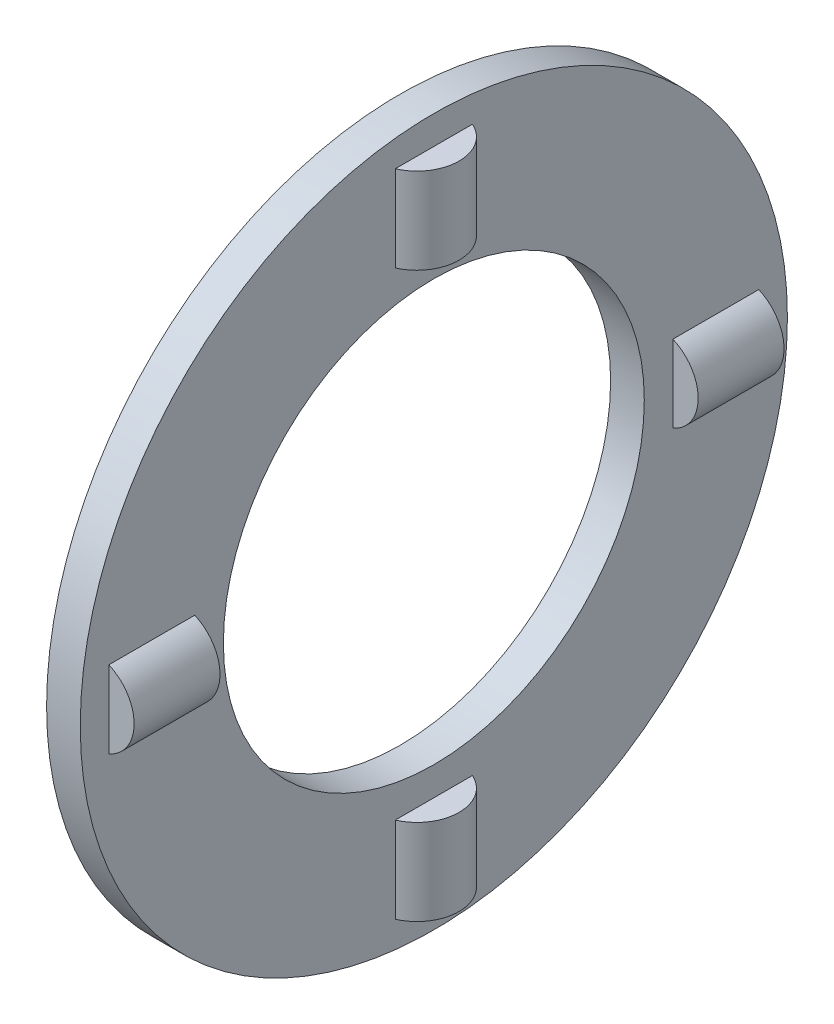
ISO-10303-21;
HEADER;
FILE_DESCRIPTION(('STEP AP214'),'2;1');
FILE_NAME('part.step','',(''),(''),'','','');
FILE_SCHEMA(('AUTOMOTIVE_DESIGN { 1 0 10303 214 1 1 1 1 }'));
ENDSEC;
DATA;
#1=APPLICATION_CONTEXT('core data for automotive mechanical design processes');
#2=APPLICATION_PROTOCOL_DEFINITION('international standard','automotive_design',2000,#1);
#3=PRODUCT_CONTEXT('',#1,'mechanical');
#4=PRODUCT('Part','Part','',(#3));
#5=PRODUCT_RELATED_PRODUCT_CATEGORY('part','',(#4));
#6=PRODUCT_DEFINITION_FORMATION('','',#4);
#7=PRODUCT_DEFINITION_CONTEXT('part definition',#1,'design');
#8=PRODUCT_DEFINITION('design','',#6,#7);
#9=PRODUCT_DEFINITION_SHAPE('','',#8);
#10=(LENGTH_UNIT() NAMED_UNIT(*) SI_UNIT(.MILLI.,.METRE.));
#11=(NAMED_UNIT(*) PLANE_ANGLE_UNIT() SI_UNIT($,.RADIAN.));
#12=(NAMED_UNIT(*) SI_UNIT($,.STERADIAN.) SOLID_ANGLE_UNIT());
#13=UNCERTAINTY_MEASURE_WITH_UNIT(LENGTH_MEASURE(1.E-05),#10,'distance_accuracy_value','');
#14=(GEOMETRIC_REPRESENTATION_CONTEXT(3) GLOBAL_UNCERTAINTY_ASSIGNED_CONTEXT((#13)) GLOBAL_UNIT_ASSIGNED_CONTEXT((#10,
#11,#12)) REPRESENTATION_CONTEXT('',''));
#15=CARTESIAN_POINT('',(0.,0.,0.));
#16=DIRECTION('',(0.,0.,1.));
#17=DIRECTION('',(1.,0.,0.));
#18=AXIS2_PLACEMENT_3D('',#15,#16,#17);
#19=CARTESIAN_POINT('',(4.5,21.,0.));
#20=DIRECTION('',(1.,0.,0.));
#21=DIRECTION('',(0.,0.,-1.));
#22=AXIS2_PLACEMENT_3D('',#19,#20,#21);
#23=PLANE('',#22);
#24=DIRECTION('',(0.,-1.,0.));
#25=VECTOR('',#24,1.);
#26=CARTESIAN_POINT('',(4.5,21.,-14.2));
#27=LINE('',#26,#25);
#28=CARTESIAN_POINT('',(4.5,2.29128784747792,-14.2));
#29=VERTEX_POINT('',#28);
#30=CARTESIAN_POINT('',(4.5,-2.29128784747792,-14.2));
#31=VERTEX_POINT('',#30);
#32=EDGE_CURVE('E297',#29,#31,#27,.T.);
#33=ORIENTED_EDGE('',*,*,#32,.T.);
#34=DIRECTION('',(0.,0.,-1.));
#35=VECTOR('',#34,1.);
#36=CARTESIAN_POINT('',(4.5,-2.29128784747792,-14.2));
#37=LINE('',#36,#35);
#38=CARTESIAN_POINT('',(4.5,-2.29128784747792,-19.3));
#39=VERTEX_POINT('',#38);
#40=EDGE_CURVE('E301',#31,#39,#37,.T.);
#41=ORIENTED_EDGE('',*,*,#40,.T.);
#42=DIRECTION('',(0.,1.,0.));
#43=VECTOR('',#42,1.);
#44=CARTESIAN_POINT('',(4.5,21.,-19.3));
#45=LINE('',#44,#43);
#46=CARTESIAN_POINT('',(4.5,2.29128784747792,-19.3));
#47=VERTEX_POINT('',#46);
#48=EDGE_CURVE('E293',#39,#47,#45,.T.);
#49=ORIENTED_EDGE('',*,*,#48,.T.);
#50=DIRECTION('',(0.,0.,-1.));
#51=VECTOR('',#50,1.);
#52=CARTESIAN_POINT('',(4.5,2.29128784747792,-14.2));
#53=LINE('',#52,#51);
#54=EDGE_CURVE('E305',#47,#29,#53,.F.);
#55=ORIENTED_EDGE('',*,*,#54,.T.);
#56=EDGE_LOOP('',(#33,#41,#49,#55));
#57=FACE_BOUND('',#56,.T.);
#58=DIRECTION('',(0.,0.,1.));
#59=VECTOR('',#58,1.);
#60=CARTESIAN_POINT('',(4.5,-14.2,0.));
#61=LINE('',#60,#59);
#62=CARTESIAN_POINT('',(4.5,-14.2,-2.29128784747792));
#63=VERTEX_POINT('',#62);
#64=CARTESIAN_POINT('',(4.5,-14.2,2.29128784747792));
#65=VERTEX_POINT('',#64);
#66=EDGE_CURVE('E272',#63,#65,#61,.T.);
#67=ORIENTED_EDGE('',*,*,#66,.T.);
#68=DIRECTION('',(0.,-1.,0.));
#69=VECTOR('',#68,1.);
#70=CARTESIAN_POINT('',(4.5,-14.2,2.29128784747792));
#71=LINE('',#70,#69);
#72=CARTESIAN_POINT('',(4.5,-19.3,2.29128784747792));
#73=VERTEX_POINT('',#72);
#74=EDGE_CURVE('E276',#65,#73,#71,.T.);
#75=ORIENTED_EDGE('',*,*,#74,.T.);
#76=DIRECTION('',(0.,0.,-1.));
#77=VECTOR('',#76,1.);
#78=CARTESIAN_POINT('',(4.5,-19.3,0.));
#79=LINE('',#78,#77);
#80=CARTESIAN_POINT('',(4.5,-19.3,-2.29128784747792));
#81=VERTEX_POINT('',#80);
#82=EDGE_CURVE('E268',#73,#81,#79,.T.);
#83=ORIENTED_EDGE('',*,*,#82,.T.);
#84=DIRECTION('',(0.,-1.,0.));
#85=VECTOR('',#84,1.);
#86=CARTESIAN_POINT('',(4.5,-14.2,-2.29128784747792));
#87=LINE('',#86,#85);
#88=EDGE_CURVE('E280',#81,#63,#87,.F.);
#89=ORIENTED_EDGE('',*,*,#88,.T.);
#90=EDGE_LOOP('',(#67,#75,#83,#89));
#91=FACE_BOUND('',#90,.T.);
#92=DIRECTION('',(0.,1.,0.));
#93=VECTOR('',#92,1.);
#94=CARTESIAN_POINT('',(4.5,21.,14.2));
#95=LINE('',#94,#93);
#96=CARTESIAN_POINT('',(4.5,-2.29128784747792,14.2));
#97=VERTEX_POINT('',#96);
#98=CARTESIAN_POINT('',(4.5,2.29128784747792,14.2));
#99=VERTEX_POINT('',#98);
#100=EDGE_CURVE('E247',#97,#99,#95,.T.);
#101=ORIENTED_EDGE('',*,*,#100,.T.);
#102=DIRECTION('',(0.,0.,1.));
#103=VECTOR('',#102,1.);
#104=CARTESIAN_POINT('',(4.5,2.29128784747792,14.2));
#105=LINE('',#104,#103);
#106=CARTESIAN_POINT('',(4.5,2.29128784747792,19.3));
#107=VERTEX_POINT('',#106);
#108=EDGE_CURVE('E251',#99,#107,#105,.T.);
#109=ORIENTED_EDGE('',*,*,#108,.T.);
#110=DIRECTION('',(0.,-1.,0.));
#111=VECTOR('',#110,1.);
#112=CARTESIAN_POINT('',(4.5,21.,19.3));
#113=LINE('',#112,#111);
#114=CARTESIAN_POINT('',(4.5,-2.29128784747792,19.3));
#115=VERTEX_POINT('',#114);
#116=EDGE_CURVE('E243',#107,#115,#113,.T.);
#117=ORIENTED_EDGE('',*,*,#116,.T.);
#118=DIRECTION('',(0.,0.,1.));
#119=VECTOR('',#118,1.);
#120=CARTESIAN_POINT('',(4.5,-2.29128784747792,14.2));
#121=LINE('',#120,#119);
#122=EDGE_CURVE('E255',#115,#97,#121,.F.);
#123=ORIENTED_EDGE('',*,*,#122,.T.);
#124=EDGE_LOOP('',(#101,#109,#117,#123));
#125=FACE_BOUND('',#124,.T.);
#126=DIRECTION('',(0.,0.,-1.));
#127=VECTOR('',#126,1.);
#128=CARTESIAN_POINT('',(4.5,14.2,0.));
#129=LINE('',#128,#127);
#130=CARTESIAN_POINT('',(4.5,14.2,2.29128784747792));
#131=VERTEX_POINT('',#130);
#132=CARTESIAN_POINT('',(4.5,14.2,-2.29128784747792));
#133=VERTEX_POINT('',#132);
#134=EDGE_CURVE('E222',#131,#133,#129,.T.);
#135=ORIENTED_EDGE('',*,*,#134,.T.);
#136=DIRECTION('',(0.,1.,0.));
#137=VECTOR('',#136,1.);
#138=CARTESIAN_POINT('',(4.5,14.2,-2.29128784747792));
#139=LINE('',#138,#137);
#140=CARTESIAN_POINT('',(4.5,19.3,-2.29128784747792));
#141=VERTEX_POINT('',#140);
#142=EDGE_CURVE('E226',#133,#141,#139,.T.);
#143=ORIENTED_EDGE('',*,*,#142,.T.);
#144=DIRECTION('',(0.,0.,1.));
#145=VECTOR('',#144,1.);
#146=CARTESIAN_POINT('',(4.5,19.3,0.));
#147=LINE('',#146,#145);
#148=CARTESIAN_POINT('',(4.5,19.3,2.29128784747792));
#149=VERTEX_POINT('',#148);
#150=EDGE_CURVE('E218',#141,#149,#147,.T.);
#151=ORIENTED_EDGE('',*,*,#150,.T.);
#152=DIRECTION('',(0.,1.,0.));
#153=VECTOR('',#152,1.);
#154=CARTESIAN_POINT('',(4.5,14.2,2.29128784747792));
#155=LINE('',#154,#153);
#156=EDGE_CURVE('E230',#149,#131,#155,.F.);
#157=ORIENTED_EDGE('',*,*,#156,.T.);
#158=EDGE_LOOP('',(#135,#143,#151,#157));
#159=FACE_BOUND('',#158,.T.);
#160=CARTESIAN_POINT('',(4.5,0.,0.));
#161=DIRECTION('',(-1.,0.,0.));
#162=DIRECTION('',(0.,0.,1.));
#163=AXIS2_PLACEMENT_3D('',#160,#161,#162);
#164=CIRCLE('',#163,12.5);
#165=CARTESIAN_POINT('',(4.5,0.,12.5));
#166=VERTEX_POINT('',#165);
#167=EDGE_CURVE('E202',#166,#166,#164,.T.);
#168=ORIENTED_EDGE('',*,*,#167,.F.);
#169=EDGE_LOOP('',(#168));
#170=FACE_BOUND('',#169,.T.);
#171=CARTESIAN_POINT('',(4.5,0.,0.));
#172=DIRECTION('',(-1.,0.,0.));
#173=DIRECTION('',(0.,0.,1.));
#174=AXIS2_PLACEMENT_3D('',#171,#172,#173);
#175=CIRCLE('',#174,21.);
#176=CARTESIAN_POINT('',(4.5,0.,21.));
#177=VERTEX_POINT('',#176);
#178=EDGE_CURVE('E214',#177,#177,#175,.T.);
#179=ORIENTED_EDGE('',*,*,#178,.T.);
#180=EDGE_LOOP('',(#179));
#181=FACE_BOUND('',#180,.T.);
#182=ADVANCED_FACE('F17',(#57,#91,#125,#159,#170,#181),#23,.F.);
#183=CARTESIAN_POINT('',(5.5,0.,0.));
#184=DIRECTION('',(-1.,0.,0.));
#185=DIRECTION('',(0.,0.,1.));
#186=AXIS2_PLACEMENT_3D('',#183,#184,#185);
#187=CYLINDRICAL_SURFACE('',#186,12.5);
#188=CARTESIAN_POINT('',(6.5,0.,0.));
#189=DIRECTION('',(-1.,0.,0.));
#190=DIRECTION('',(0.,0.,1.));
#191=AXIS2_PLACEMENT_3D('',#188,#189,#190);
#192=CIRCLE('',#191,12.5);
#193=CARTESIAN_POINT('',(6.5,0.,12.5));
#194=VERTEX_POINT('',#193);
#195=EDGE_CURVE('E206',#194,#194,#192,.T.);
#196=ORIENTED_EDGE('',*,*,#195,.F.);
#197=EDGE_LOOP('',(#196));
#198=FACE_BOUND('',#197,.T.);
#199=ORIENTED_EDGE('',*,*,#167,.T.);
#200=EDGE_LOOP('',(#199));
#201=FACE_BOUND('',#200,.T.);
#202=ADVANCED_FACE('F563',(#198,#201),#187,.F.);
#203=CARTESIAN_POINT('',(6.5,12.5,0.));
#204=DIRECTION('',(-1.,0.,0.));
#205=DIRECTION('',(0.,0.,1.));
#206=AXIS2_PLACEMENT_3D('',#203,#204,#205);
#207=PLANE('',#206);
#208=DIRECTION('',(0.,1.,0.));
#209=VECTOR('',#208,1.);
#210=CARTESIAN_POINT('',(6.5,12.5,-14.2));
#211=LINE('',#210,#209);
#212=CARTESIAN_POINT('',(6.5,-2.29128784747792,-14.2));
#213=VERTEX_POINT('',#212);
#214=CARTESIAN_POINT('',(6.5,2.29128784747792,-14.2));
#215=VERTEX_POINT('',#214);
#216=EDGE_CURVE('E136',#213,#215,#211,.T.);
#217=ORIENTED_EDGE('',*,*,#216,.T.);
#218=DIRECTION('',(0.,0.,-1.));
#219=VECTOR('',#218,1.);
#220=CARTESIAN_POINT('',(6.5,2.29128784747792,-14.2));
#221=LINE('',#220,#219);
#222=CARTESIAN_POINT('',(6.5,2.29128784747792,-19.3));
#223=VERTEX_POINT('',#222);
#224=EDGE_CURVE('E11',#215,#223,#221,.T.);
#225=ORIENTED_EDGE('',*,*,#224,.T.);
#226=DIRECTION('',(0.,-1.,0.));
#227=VECTOR('',#226,1.);
#228=CARTESIAN_POINT('',(6.5,12.5,-19.3));
#229=LINE('',#228,#227);
#230=CARTESIAN_POINT('',(6.5,-2.29128784747792,-19.3));
#231=VERTEX_POINT('',#230);
#232=EDGE_CURVE('E25',#223,#231,#229,.T.);
#233=ORIENTED_EDGE('',*,*,#232,.T.);
#234=DIRECTION('',(0.,0.,-1.));
#235=VECTOR('',#234,1.);
#236=CARTESIAN_POINT('',(6.5,-2.29128784747792,-14.2));
#237=LINE('',#236,#235);
#238=EDGE_CURVE('E138',#231,#213,#237,.F.);
#239=ORIENTED_EDGE('',*,*,#238,.T.);
#240=EDGE_LOOP('',(#217,#225,#233,#239));
#241=FACE_BOUND('',#240,.T.);
#242=DIRECTION('',(0.,0.,-1.));
#243=VECTOR('',#242,1.);
#244=CARTESIAN_POINT('',(6.5,-14.2,0.));
#245=LINE('',#244,#243);
#246=CARTESIAN_POINT('',(6.5,-14.2,2.29128784747792));
#247=VERTEX_POINT('',#246);
#248=CARTESIAN_POINT('',(6.5,-14.2,-2.29128784747792));
#249=VERTEX_POINT('',#248);
#250=EDGE_CURVE('E162',#247,#249,#245,.T.);
#251=ORIENTED_EDGE('',*,*,#250,.T.);
#252=DIRECTION('',(0.,-1.,0.));
#253=VECTOR('',#252,1.);
#254=CARTESIAN_POINT('',(6.5,-14.2,-2.29128784747792));
#255=LINE('',#254,#253);
#256=CARTESIAN_POINT('',(6.5,-19.3,-2.29128784747792));
#257=VERTEX_POINT('',#256);
#258=EDGE_CURVE('E152',#249,#257,#255,.T.);
#259=ORIENTED_EDGE('',*,*,#258,.T.);
#260=DIRECTION('',(0.,0.,1.));
#261=VECTOR('',#260,1.);
#262=CARTESIAN_POINT('',(6.5,-19.3,0.));
#263=LINE('',#262,#261);
#264=CARTESIAN_POINT('',(6.5,-19.3,2.29128784747792));
#265=VERTEX_POINT('',#264);
#266=EDGE_CURVE('E158',#257,#265,#263,.T.);
#267=ORIENTED_EDGE('',*,*,#266,.T.);
#268=DIRECTION('',(0.,-1.,0.));
#269=VECTOR('',#268,1.);
#270=CARTESIAN_POINT('',(6.5,-14.2,2.29128784747792));
#271=LINE('',#270,#269);
#272=EDGE_CURVE('E166',#265,#247,#271,.F.);
#273=ORIENTED_EDGE('',*,*,#272,.T.);
#274=EDGE_LOOP('',(#251,#259,#267,#273));
#275=FACE_BOUND('',#274,.T.);
#276=DIRECTION('',(0.,-1.,0.));
#277=VECTOR('',#276,1.);
#278=CARTESIAN_POINT('',(6.5,12.5,14.2));
#279=LINE('',#278,#277);
#280=CARTESIAN_POINT('',(6.5,2.29128784747792,14.2));
#281=VERTEX_POINT('',#280);
#282=CARTESIAN_POINT('',(6.5,-2.29128784747792,14.2));
#283=VERTEX_POINT('',#282);
#284=EDGE_CURVE('E178',#281,#283,#279,.T.);
#285=ORIENTED_EDGE('',*,*,#284,.T.);
#286=DIRECTION('',(0.,0.,1.));
#287=VECTOR('',#286,1.);
#288=CARTESIAN_POINT('',(6.5,-2.29128784747792,14.2));
#289=LINE('',#288,#287);
#290=CARTESIAN_POINT('',(6.5,-2.29128784747792,19.3));
#291=VERTEX_POINT('',#290);
#292=EDGE_CURVE('E170',#283,#291,#289,.T.);
#293=ORIENTED_EDGE('',*,*,#292,.T.);
#294=DIRECTION('',(0.,1.,0.));
#295=VECTOR('',#294,1.);
#296=CARTESIAN_POINT('',(6.5,12.5,19.3));
#297=LINE('',#296,#295);
#298=CARTESIAN_POINT('',(6.5,2.29128784747792,19.3));
#299=VERTEX_POINT('',#298);
#300=EDGE_CURVE('E174',#291,#299,#297,.T.);
#301=ORIENTED_EDGE('',*,*,#300,.T.);
#302=DIRECTION('',(0.,0.,1.));
#303=VECTOR('',#302,1.);
#304=CARTESIAN_POINT('',(6.5,2.29128784747792,14.2));
#305=LINE('',#304,#303);
#306=EDGE_CURVE('E182',#299,#281,#305,.F.);
#307=ORIENTED_EDGE('',*,*,#306,.T.);
#308=EDGE_LOOP('',(#285,#293,#301,#307));
#309=FACE_BOUND('',#308,.T.);
#310=DIRECTION('',(0.,0.,1.));
#311=VECTOR('',#310,1.);
#312=CARTESIAN_POINT('',(6.5,14.2,0.));
#313=LINE('',#312,#311);
#314=CARTESIAN_POINT('',(6.5,14.2,-2.29128784747792));
#315=VERTEX_POINT('',#314);
#316=CARTESIAN_POINT('',(6.5,14.2,2.29128784747792));
#317=VERTEX_POINT('',#316);
#318=EDGE_CURVE('E194',#315,#317,#313,.T.);
#319=ORIENTED_EDGE('',*,*,#318,.T.);
#320=DIRECTION('',(0.,1.,0.));
#321=VECTOR('',#320,1.);
#322=CARTESIAN_POINT('',(6.5,14.2,2.29128784747792));
#323=LINE('',#322,#321);
#324=CARTESIAN_POINT('',(6.5,19.3,2.29128784747792));
#325=VERTEX_POINT('',#324);
#326=EDGE_CURVE('E186',#317,#325,#323,.T.);
#327=ORIENTED_EDGE('',*,*,#326,.T.);
#328=DIRECTION('',(0.,0.,-1.));
#329=VECTOR('',#328,1.);
#330=CARTESIAN_POINT('',(6.5,19.3,0.));
#331=LINE('',#330,#329);
#332=CARTESIAN_POINT('',(6.5,19.3,-2.29128784747792));
#333=VERTEX_POINT('',#332);
#334=EDGE_CURVE('E190',#325,#333,#331,.T.);
#335=ORIENTED_EDGE('',*,*,#334,.T.);
#336=DIRECTION('',(0.,1.,0.));
#337=VECTOR('',#336,1.);
#338=CARTESIAN_POINT('',(6.5,14.2,-2.29128784747792));
#339=LINE('',#338,#337);
#340=EDGE_CURVE('E198',#333,#315,#339,.F.);
#341=ORIENTED_EDGE('',*,*,#340,.T.);
#342=EDGE_LOOP('',(#319,#327,#335,#341));
#343=FACE_BOUND('',#342,.T.);
#344=CARTESIAN_POINT('',(6.5,0.,0.));
#345=DIRECTION('',(-1.,0.,0.));
#346=DIRECTION('',(0.,0.,1.));
#347=AXIS2_PLACEMENT_3D('',#344,#345,#346);
#348=CIRCLE('',#347,21.);
#349=CARTESIAN_POINT('',(6.5,0.,21.));
#350=VERTEX_POINT('',#349);
#351=EDGE_CURVE('E210',#350,#350,#348,.T.);
#352=ORIENTED_EDGE('',*,*,#351,.F.);
#353=EDGE_LOOP('',(#352));
#354=FACE_BOUND('',#353,.T.);
#355=ORIENTED_EDGE('',*,*,#195,.T.);
#356=EDGE_LOOP('',(#355));
#357=FACE_BOUND('',#356,.T.);
#358=ADVANCED_FACE('F143',(#241,#275,#309,#343,#354,#357),#207,.F.);
#359=CARTESIAN_POINT('',(5.5,0.,0.));
#360=DIRECTION('',(-1.,0.,0.));
#361=DIRECTION('',(0.,0.,1.));
#362=AXIS2_PLACEMENT_3D('',#359,#360,#361);
#363=CYLINDRICAL_SURFACE('',#362,21.);
#364=ORIENTED_EDGE('',*,*,#178,.F.);
#365=EDGE_LOOP('',(#364));
#366=FACE_BOUND('',#365,.T.);
#367=ORIENTED_EDGE('',*,*,#351,.T.);
#368=EDGE_LOOP('',(#367));
#369=FACE_BOUND('',#368,.T.);
#370=ADVANCED_FACE('F546',(#366,#369),#363,.T.);
#371=CARTESIAN_POINT('',(5.5,14.2,0.));
#372=DIRECTION('',(0.,1.,0.));
#373=DIRECTION('',(1.,0.,0.));
#374=AXIS2_PLACEMENT_3D('',#371,#372,#373);
#375=CYLINDRICAL_SURFACE('',#374,2.5);
#376=ORIENTED_EDGE('',*,*,#326,.F.);
#377=CARTESIAN_POINT('',(5.5,14.2,0.));
#378=DIRECTION('',(0.,1.,0.));
#379=DIRECTION('',(1.,0.,0.));
#380=AXIS2_PLACEMENT_3D('',#377,#378,#379);
#381=CIRCLE('',#380,2.5);
#382=EDGE_CURVE('E240',#317,#315,#381,.T.);
#383=ORIENTED_EDGE('',*,*,#382,.T.);
#384=ORIENTED_EDGE('',*,*,#340,.F.);
#385=CARTESIAN_POINT('',(5.5,19.3,0.));
#386=DIRECTION('',(0.,-1.,0.));
#387=DIRECTION('',(1.,0.,0.));
#388=AXIS2_PLACEMENT_3D('',#385,#386,#387);
#389=CIRCLE('',#388,2.5);
#390=EDGE_CURVE('E235',#333,#325,#389,.T.);
#391=ORIENTED_EDGE('',*,*,#390,.T.);
#392=EDGE_LOOP('',(#376,#383,#384,#391));
#393=FACE_BOUND('',#392,.T.);
#394=ADVANCED_FACE('F499',(#393),#375,.T.);
#395=CARTESIAN_POINT('',(5.5,14.2,0.));
#396=DIRECTION('',(0.,-1.,0.));
#397=DIRECTION('',(0.,0.,-1.));
#398=AXIS2_PLACEMENT_3D('',#395,#396,#397);
#399=PLANE('',#398);
#400=ORIENTED_EDGE('',*,*,#318,.F.);
#401=ORIENTED_EDGE('',*,*,#382,.F.);
#402=EDGE_LOOP('',(#400,#401));
#403=FACE_BOUND('',#402,.T.);
#404=ADVANCED_FACE('F511',(#403),#399,.T.);
#405=CARTESIAN_POINT('',(5.5,19.3,0.));
#406=DIRECTION('',(0.,1.,0.));
#407=DIRECTION('',(0.,0.,1.));
#408=AXIS2_PLACEMENT_3D('',#405,#406,#407);
#409=PLANE('',#408);
#410=ORIENTED_EDGE('',*,*,#334,.F.);
#411=ORIENTED_EDGE('',*,*,#390,.F.);
#412=EDGE_LOOP('',(#410,#411));
#413=FACE_BOUND('',#412,.T.);
#414=ADVANCED_FACE('F520',(#413),#409,.T.);
#415=ORIENTED_EDGE('',*,*,#150,.F.);
#416=EDGE_CURVE('E234',#149,#141,#389,.T.);
#417=ORIENTED_EDGE('',*,*,#416,.F.);
#418=EDGE_LOOP('',(#415,#417));
#419=FACE_BOUND('',#418,.T.);
#420=ADVANCED_FACE('F508',(#419),#409,.T.);
#421=ORIENTED_EDGE('',*,*,#134,.F.);
#422=EDGE_CURVE('E239',#133,#131,#381,.T.);
#423=ORIENTED_EDGE('',*,*,#422,.F.);
#424=EDGE_LOOP('',(#421,#423));
#425=FACE_BOUND('',#424,.T.);
#426=ADVANCED_FACE('F496',(#425),#399,.T.);
#427=ORIENTED_EDGE('',*,*,#142,.F.);
#428=ORIENTED_EDGE('',*,*,#422,.T.);
#429=ORIENTED_EDGE('',*,*,#156,.F.);
#430=ORIENTED_EDGE('',*,*,#416,.T.);
#431=EDGE_LOOP('',(#427,#428,#429,#430));
#432=FACE_BOUND('',#431,.T.);
#433=ADVANCED_FACE('F487',(#432),#375,.T.);
#434=CARTESIAN_POINT('',(5.5,0.,14.2));
#435=DIRECTION('',(0.,0.,1.));
#436=DIRECTION('',(1.,0.,0.));
#437=AXIS2_PLACEMENT_3D('',#434,#435,#436);
#438=CYLINDRICAL_SURFACE('',#437,2.5);
#439=ORIENTED_EDGE('',*,*,#292,.F.);
#440=CARTESIAN_POINT('',(5.5,0.,14.2));
#441=DIRECTION('',(0.,0.,1.));
#442=DIRECTION('',(1.,0.,0.));
#443=AXIS2_PLACEMENT_3D('',#440,#441,#442);
#444=CIRCLE('',#443,2.5);
#445=EDGE_CURVE('E265',#283,#281,#444,.T.);
#446=ORIENTED_EDGE('',*,*,#445,.T.);
#447=ORIENTED_EDGE('',*,*,#306,.F.);
#448=CARTESIAN_POINT('',(5.5,0.,19.3));
#449=DIRECTION('',(0.,0.,-1.));
#450=DIRECTION('',(1.,0.,0.));
#451=AXIS2_PLACEMENT_3D('',#448,#449,#450);
#452=CIRCLE('',#451,2.5);
#453=EDGE_CURVE('E260',#299,#291,#452,.T.);
#454=ORIENTED_EDGE('',*,*,#453,.T.);
#455=EDGE_LOOP('',(#439,#446,#447,#454));
#456=FACE_BOUND('',#455,.T.);
#457=ADVANCED_FACE('F440',(#456),#438,.T.);
#458=CARTESIAN_POINT('',(5.5,0.,14.2));
#459=DIRECTION('',(0.,0.,-1.));
#460=DIRECTION('',(0.,1.,0.));
#461=AXIS2_PLACEMENT_3D('',#458,#459,#460);
#462=PLANE('',#461);
#463=ORIENTED_EDGE('',*,*,#284,.F.);
#464=ORIENTED_EDGE('',*,*,#445,.F.);
#465=EDGE_LOOP('',(#463,#464));
#466=FACE_BOUND('',#465,.T.);
#467=ADVANCED_FACE('F452',(#466),#462,.T.);
#468=CARTESIAN_POINT('',(5.5,0.,19.3));
#469=DIRECTION('',(0.,0.,1.));
#470=DIRECTION('',(0.,-1.,0.));
#471=AXIS2_PLACEMENT_3D('',#468,#469,#470);
#472=PLANE('',#471);
#473=ORIENTED_EDGE('',*,*,#300,.F.);
#474=ORIENTED_EDGE('',*,*,#453,.F.);
#475=EDGE_LOOP('',(#473,#474));
#476=FACE_BOUND('',#475,.T.);
#477=ADVANCED_FACE('F461',(#476),#472,.T.);
#478=ORIENTED_EDGE('',*,*,#116,.F.);
#479=EDGE_CURVE('E259',#115,#107,#452,.T.);
#480=ORIENTED_EDGE('',*,*,#479,.F.);
#481=EDGE_LOOP('',(#478,#480));
#482=FACE_BOUND('',#481,.T.);
#483=ADVANCED_FACE('F449',(#482),#472,.T.);
#484=ORIENTED_EDGE('',*,*,#100,.F.);
#485=EDGE_CURVE('E264',#99,#97,#444,.T.);
#486=ORIENTED_EDGE('',*,*,#485,.F.);
#487=EDGE_LOOP('',(#484,#486));
#488=FACE_BOUND('',#487,.T.);
#489=ADVANCED_FACE('F437',(#488),#462,.T.);
#490=ORIENTED_EDGE('',*,*,#108,.F.);
#491=ORIENTED_EDGE('',*,*,#485,.T.);
#492=ORIENTED_EDGE('',*,*,#122,.F.);
#493=ORIENTED_EDGE('',*,*,#479,.T.);
#494=EDGE_LOOP('',(#490,#491,#492,#493));
#495=FACE_BOUND('',#494,.T.);
#496=ADVANCED_FACE('F428',(#495),#438,.T.);
#497=CARTESIAN_POINT('',(5.5,-14.2,0.));
#498=DIRECTION('',(0.,-1.,0.));
#499=DIRECTION('',(1.,0.,0.));
#500=AXIS2_PLACEMENT_3D('',#497,#498,#499);
#501=CYLINDRICAL_SURFACE('',#500,2.5);
#502=ORIENTED_EDGE('',*,*,#258,.F.);
#503=CARTESIAN_POINT('',(5.5,-14.2,0.));
#504=DIRECTION('',(0.,-1.,0.));
#505=DIRECTION('',(1.,0.,0.));
#506=AXIS2_PLACEMENT_3D('',#503,#504,#505);
#507=CIRCLE('',#506,2.5);
#508=EDGE_CURVE('E290',#249,#247,#507,.T.);
#509=ORIENTED_EDGE('',*,*,#508,.T.);
#510=ORIENTED_EDGE('',*,*,#272,.F.);
#511=CARTESIAN_POINT('',(5.5,-19.3,0.));
#512=DIRECTION('',(0.,1.,0.));
#513=DIRECTION('',(1.,0.,0.));
#514=AXIS2_PLACEMENT_3D('',#511,#512,#513);
#515=CIRCLE('',#514,2.5);
#516=EDGE_CURVE('E285',#265,#257,#515,.T.);
#517=ORIENTED_EDGE('',*,*,#516,.T.);
#518=EDGE_LOOP('',(#502,#509,#510,#517));
#519=FACE_BOUND('',#518,.T.);
#520=ADVANCED_FACE('F381',(#519),#501,.T.);
#521=CARTESIAN_POINT('',(5.5,-14.2,0.));
#522=DIRECTION('',(0.,1.,0.));
#523=DIRECTION('',(0.,0.,1.));
#524=AXIS2_PLACEMENT_3D('',#521,#522,#523);
#525=PLANE('',#524);
#526=ORIENTED_EDGE('',*,*,#250,.F.);
#527=ORIENTED_EDGE('',*,*,#508,.F.);
#528=EDGE_LOOP('',(#526,#527));
#529=FACE_BOUND('',#528,.T.);
#530=ADVANCED_FACE('F393',(#529),#525,.T.);
#531=CARTESIAN_POINT('',(5.5,-19.3,0.));
#532=DIRECTION('',(0.,-1.,0.));
#533=DIRECTION('',(0.,0.,-1.));
#534=AXIS2_PLACEMENT_3D('',#531,#532,#533);
#535=PLANE('',#534);
#536=ORIENTED_EDGE('',*,*,#266,.F.);
#537=ORIENTED_EDGE('',*,*,#516,.F.);
#538=EDGE_LOOP('',(#536,#537));
#539=FACE_BOUND('',#538,.T.);
#540=ADVANCED_FACE('F402',(#539),#535,.T.);
#541=ORIENTED_EDGE('',*,*,#82,.F.);
#542=EDGE_CURVE('E284',#81,#73,#515,.T.);
#543=ORIENTED_EDGE('',*,*,#542,.F.);
#544=EDGE_LOOP('',(#541,#543));
#545=FACE_BOUND('',#544,.T.);
#546=ADVANCED_FACE('F390',(#545),#535,.T.);
#547=ORIENTED_EDGE('',*,*,#66,.F.);
#548=EDGE_CURVE('E289',#65,#63,#507,.T.);
#549=ORIENTED_EDGE('',*,*,#548,.F.);
#550=EDGE_LOOP('',(#547,#549));
#551=FACE_BOUND('',#550,.T.);
#552=ADVANCED_FACE('F378',(#551),#525,.T.);
#553=ORIENTED_EDGE('',*,*,#74,.F.);
#554=ORIENTED_EDGE('',*,*,#548,.T.);
#555=ORIENTED_EDGE('',*,*,#88,.F.);
#556=ORIENTED_EDGE('',*,*,#542,.T.);
#557=EDGE_LOOP('',(#553,#554,#555,#556));
#558=FACE_BOUND('',#557,.T.);
#559=ADVANCED_FACE('F370',(#558),#501,.T.);
#560=CARTESIAN_POINT('',(5.5,0.,-14.2));
#561=DIRECTION('',(0.,0.,-1.));
#562=DIRECTION('',(1.,0.,0.));
#563=AXIS2_PLACEMENT_3D('',#560,#561,#562);
#564=CYLINDRICAL_SURFACE('',#563,2.5);
#565=ORIENTED_EDGE('',*,*,#224,.F.);
#566=CARTESIAN_POINT('',(5.5,0.,-14.2));
#567=DIRECTION('',(0.,0.,-1.));
#568=DIRECTION('',(1.,0.,0.));
#569=AXIS2_PLACEMENT_3D('',#566,#567,#568);
#570=CIRCLE('',#569,2.5);
#571=EDGE_CURVE('E40',#215,#213,#570,.T.);
#572=ORIENTED_EDGE('',*,*,#571,.T.);
#573=ORIENTED_EDGE('',*,*,#238,.F.);
#574=CARTESIAN_POINT('',(5.5,0.,-19.3));
#575=DIRECTION('',(0.,0.,1.));
#576=DIRECTION('',(1.,0.,0.));
#577=AXIS2_PLACEMENT_3D('',#574,#575,#576);
#578=CIRCLE('',#577,2.5);
#579=EDGE_CURVE('E132',#231,#223,#578,.T.);
#580=ORIENTED_EDGE('',*,*,#579,.T.);
#581=EDGE_LOOP('',(#565,#572,#573,#580));
#582=FACE_BOUND('',#581,.T.);
#583=ADVANCED_FACE('F137',(#582),#564,.T.);
#584=CARTESIAN_POINT('',(5.5,0.,-14.2));
#585=DIRECTION('',(0.,0.,1.));
#586=DIRECTION('',(0.,-1.,0.));
#587=AXIS2_PLACEMENT_3D('',#584,#585,#586);
#588=PLANE('',#587);
#589=ORIENTED_EDGE('',*,*,#216,.F.);
#590=ORIENTED_EDGE('',*,*,#571,.F.);
#591=EDGE_LOOP('',(#589,#590));
#592=FACE_BOUND('',#591,.T.);
#593=ADVANCED_FACE('F341',(#592),#588,.T.);
#594=CARTESIAN_POINT('',(5.5,0.,-19.3));
#595=DIRECTION('',(0.,0.,-1.));
#596=DIRECTION('',(0.,1.,0.));
#597=AXIS2_PLACEMENT_3D('',#594,#595,#596);
#598=PLANE('',#597);
#599=ORIENTED_EDGE('',*,*,#232,.F.);
#600=ORIENTED_EDGE('',*,*,#579,.F.);
#601=EDGE_LOOP('',(#599,#600));
#602=FACE_BOUND('',#601,.T.);
#603=ADVANCED_FACE('F131',(#602),#598,.T.);
#604=ORIENTED_EDGE('',*,*,#48,.F.);
#605=EDGE_CURVE('E140',#47,#39,#578,.T.);
#606=ORIENTED_EDGE('',*,*,#605,.F.);
#607=EDGE_LOOP('',(#604,#606));
#608=FACE_BOUND('',#607,.T.);
#609=ADVANCED_FACE('F338',(#608),#598,.T.);
#610=ORIENTED_EDGE('',*,*,#32,.F.);
#611=EDGE_CURVE('E32',#31,#29,#570,.T.);
#612=ORIENTED_EDGE('',*,*,#611,.F.);
#613=EDGE_LOOP('',(#610,#612));
#614=FACE_BOUND('',#613,.T.);
#615=ADVANCED_FACE('F318',(#614),#588,.T.);
#616=ORIENTED_EDGE('',*,*,#40,.F.);
#617=ORIENTED_EDGE('',*,*,#611,.T.);
#618=ORIENTED_EDGE('',*,*,#54,.F.);
#619=ORIENTED_EDGE('',*,*,#605,.T.);
#620=EDGE_LOOP('',(#616,#617,#618,#619));
#621=FACE_BOUND('',#620,.T.);
#622=ADVANCED_FACE('F322',(#621),#564,.T.);
#623=CLOSED_SHELL('',(#182,#202,#358,#370,#394,#404,#414,#420,#426,#433,#457,#467,#477,#483,
#489,#496,#520,#530,#540,#546,#552,#559,#583,#593,#603,#609,#615,#622));
#624=MANIFOLD_SOLID_BREP('B1',#623);
#625=ADVANCED_BREP_SHAPE_REPRESENTATION('',(#18,#624),#14);
#626=SHAPE_DEFINITION_REPRESENTATION(#9,#625);
ENDSEC;
END-ISO-10303-21;
